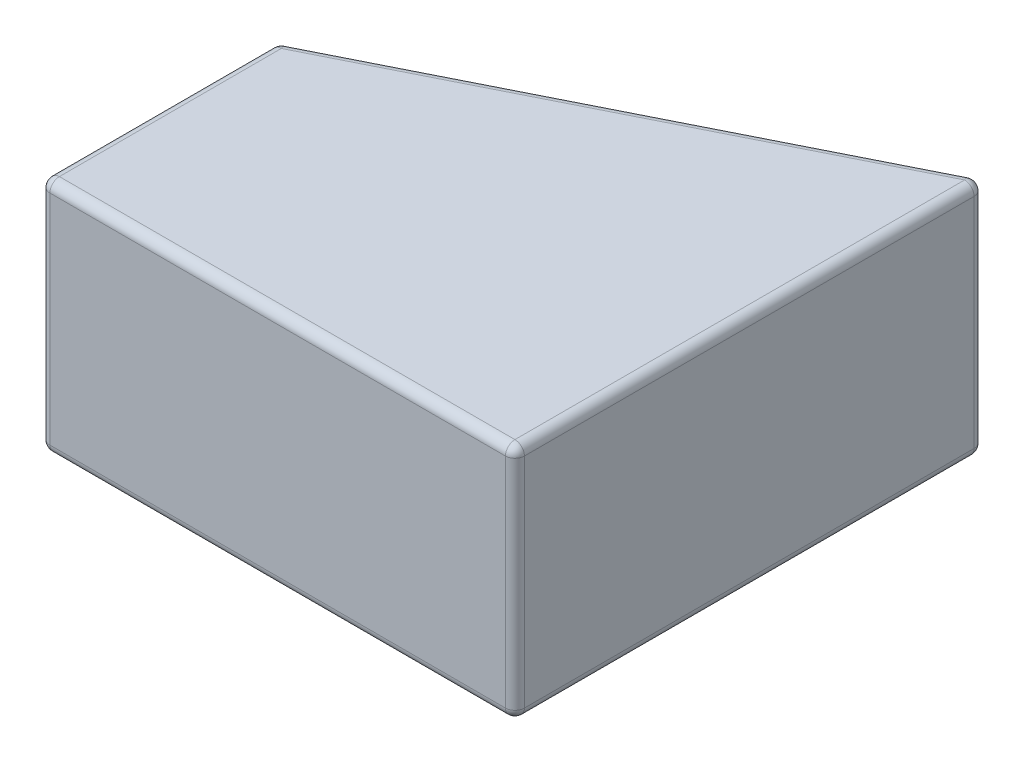
ISO-10303-21;
HEADER;
FILE_DESCRIPTION(('STEP AP214'),'2;1');
FILE_NAME('part.step','',(''),(''),'','','');
FILE_SCHEMA(('AUTOMOTIVE_DESIGN { 1 0 10303 214 1 1 1 1 }'));
ENDSEC;
DATA;
#1=APPLICATION_CONTEXT('core data for automotive mechanical design processes');
#2=APPLICATION_PROTOCOL_DEFINITION('international standard','automotive_design',2000,#1);
#3=PRODUCT_CONTEXT('',#1,'mechanical');
#4=PRODUCT('Part','Part','',(#3));
#5=PRODUCT_RELATED_PRODUCT_CATEGORY('part','',(#4));
#6=PRODUCT_DEFINITION_FORMATION('','',#4);
#7=PRODUCT_DEFINITION_CONTEXT('part definition',#1,'design');
#8=PRODUCT_DEFINITION('design','',#6,#7);
#9=PRODUCT_DEFINITION_SHAPE('','',#8);
#10=(LENGTH_UNIT() NAMED_UNIT(*) SI_UNIT(.MILLI.,.METRE.));
#11=(NAMED_UNIT(*) PLANE_ANGLE_UNIT() SI_UNIT($,.RADIAN.));
#12=(NAMED_UNIT(*) SI_UNIT($,.STERADIAN.) SOLID_ANGLE_UNIT());
#13=UNCERTAINTY_MEASURE_WITH_UNIT(LENGTH_MEASURE(1.E-05),#10,'distance_accuracy_value','');
#14=(GEOMETRIC_REPRESENTATION_CONTEXT(3) GLOBAL_UNCERTAINTY_ASSIGNED_CONTEXT((#13)) GLOBAL_UNIT_ASSIGNED_CONTEXT((#10,
#11,#12)) REPRESENTATION_CONTEXT('',''));
#15=CARTESIAN_POINT('',(0.,0.,0.));
#16=DIRECTION('',(0.,0.,1.));
#17=DIRECTION('',(1.,0.,0.));
#18=AXIS2_PLACEMENT_3D('',#15,#16,#17);
#19=CARTESIAN_POINT('',(10.,5.,0.));
#20=DIRECTION('',(1.,0.,0.));
#21=DIRECTION('',(0.,0.,-1.));
#22=AXIS2_PLACEMENT_3D('',#19,#20,#21);
#23=PLANE('',#22);
#24=DIRECTION('',(0.,-1.,0.));
#25=VECTOR('',#24,1.);
#26=CARTESIAN_POINT('',(10.,0.,-0.2));
#27=LINE('',#26,#25);
#28=CARTESIAN_POINT('',(10.,4.8,-0.2));
#29=VERTEX_POINT('',#28);
#30=CARTESIAN_POINT('',(10.,0.2,-0.2));
#31=VERTEX_POINT('',#30);
#32=EDGE_CURVE('E270',#29,#31,#27,.T.);
#33=ORIENTED_EDGE('',*,*,#32,.T.);
#34=DIRECTION('',(0.,0.,1.));
#35=VECTOR('',#34,1.);
#36=CARTESIAN_POINT('',(10.,0.2,-10.));
#37=LINE('',#36,#35);
#38=CARTESIAN_POINT('',(10.,0.2,-9.67639320225002));
#39=VERTEX_POINT('',#38);
#40=EDGE_CURVE('E170',#31,#39,#37,.F.);
#41=ORIENTED_EDGE('',*,*,#40,.T.);
#42=DIRECTION('',(0.,-1.,0.));
#43=VECTOR('',#42,1.);
#44=CARTESIAN_POINT('',(10.,5.,-9.67639320225002));
#45=LINE('',#44,#43);
#46=CARTESIAN_POINT('',(10.,4.8,-9.67639320225002));
#47=VERTEX_POINT('',#46);
#48=EDGE_CURVE('E264',#39,#47,#45,.F.);
#49=ORIENTED_EDGE('',*,*,#48,.T.);
#50=DIRECTION('',(0.,0.,1.));
#51=VECTOR('',#50,1.);
#52=CARTESIAN_POINT('',(10.,4.8,0.));
#53=LINE('',#52,#51);
#54=EDGE_CURVE('E267',#47,#29,#53,.T.);
#55=ORIENTED_EDGE('',*,*,#54,.T.);
#56=EDGE_LOOP('',(#33,#41,#49,#55));
#57=FACE_BOUND('',#56,.T.);
#58=ADVANCED_FACE('F43',(#57),#23,.T.);
#59=CARTESIAN_POINT('',(-2.,5.,-4.));
#60=DIRECTION('',(-0.447213595499958,0.,-0.894427190999916));
#61=DIRECTION('',(-0.894427190999916,0.,0.447213595499958));
#62=AXIS2_PLACEMENT_3D('',#59,#60,#61);
#63=PLANE('',#62);
#64=DIRECTION('',(0.894427190999916,0.,-0.447213595499958));
#65=VECTOR('',#64,1.);
#66=CARTESIAN_POINT('',(0.,0.2,-5.));
#67=LINE('',#66,#65);
#68=CARTESIAN_POINT('',(9.71055728090001,0.2,-9.85527864045));
#69=VERTEX_POINT('',#68);
#70=CARTESIAN_POINT('',(0.110557280900008,0.2,-5.05527864045));
#71=VERTEX_POINT('',#70);
#72=EDGE_CURVE('E326',#69,#71,#67,.F.);
#73=ORIENTED_EDGE('',*,*,#72,.T.);
#74=DIRECTION('',(0.,-1.,0.));
#75=VECTOR('',#74,1.);
#76=CARTESIAN_POINT('',(0.110557280900008,5.,-5.05527864045));
#77=LINE('',#76,#75);
#78=CARTESIAN_POINT('',(0.110557280900008,4.8,-5.05527864045));
#79=VERTEX_POINT('',#78);
#80=EDGE_CURVE('E257',#71,#79,#77,.F.);
#81=ORIENTED_EDGE('',*,*,#80,.T.);
#82=DIRECTION('',(0.894427190999916,0.,-0.447213595499958));
#83=VECTOR('',#82,1.);
#84=CARTESIAN_POINT('',(-2.,4.8,-4.));
#85=LINE('',#84,#83);
#86=CARTESIAN_POINT('',(9.71055728090001,4.8,-9.85527864045));
#87=VERTEX_POINT('',#86);
#88=EDGE_CURVE('E335',#79,#87,#85,.T.);
#89=ORIENTED_EDGE('',*,*,#88,.T.);
#90=DIRECTION('',(0.,-1.,0.));
#91=VECTOR('',#90,1.);
#92=CARTESIAN_POINT('',(9.71055728090001,5.,-9.85527864045));
#93=LINE('',#92,#91);
#94=EDGE_CURVE('E330',#87,#69,#93,.T.);
#95=ORIENTED_EDGE('',*,*,#94,.T.);
#96=EDGE_LOOP('',(#73,#81,#89,#95));
#97=FACE_BOUND('',#96,.T.);
#98=ADVANCED_FACE('F328',(#97),#63,.T.);
#99=CARTESIAN_POINT('',(0.,5.,0.));
#100=DIRECTION('',(-1.,0.,0.));
#101=DIRECTION('',(0.,0.,1.));
#102=AXIS2_PLACEMENT_3D('',#99,#100,#101);
#103=PLANE('',#102);
#104=DIRECTION('',(0.,-1.,0.));
#105=VECTOR('',#104,1.);
#106=CARTESIAN_POINT('',(0.,5.,-4.87639320225002));
#107=LINE('',#106,#105);
#108=CARTESIAN_POINT('',(0.,4.8,-4.87639320225002));
#109=VERTEX_POINT('',#108);
#110=CARTESIAN_POINT('',(0.,0.2,-4.87639320225002));
#111=VERTEX_POINT('',#110);
#112=EDGE_CURVE('E251',#109,#111,#107,.T.);
#113=ORIENTED_EDGE('',*,*,#112,.T.);
#114=DIRECTION('',(0.,0.,-1.));
#115=VECTOR('',#114,1.);
#116=CARTESIAN_POINT('',(0.,0.2,0.));
#117=LINE('',#116,#115);
#118=CARTESIAN_POINT('',(0.,0.2,-0.2));
#119=VERTEX_POINT('',#118);
#120=EDGE_CURVE('E255',#111,#119,#117,.F.);
#121=ORIENTED_EDGE('',*,*,#120,.T.);
#122=DIRECTION('',(0.,-1.,0.));
#123=VECTOR('',#122,1.);
#124=CARTESIAN_POINT('',(0.,5.,-0.2));
#125=LINE('',#124,#123);
#126=CARTESIAN_POINT('',(0.,4.8,-0.2));
#127=VERTEX_POINT('',#126);
#128=EDGE_CURVE('E250',#119,#127,#125,.F.);
#129=ORIENTED_EDGE('',*,*,#128,.T.);
#130=DIRECTION('',(0.,0.,-1.));
#131=VECTOR('',#130,1.);
#132=CARTESIAN_POINT('',(0.,4.8,0.));
#133=LINE('',#132,#131);
#134=EDGE_CURVE('E246',#127,#109,#133,.T.);
#135=ORIENTED_EDGE('',*,*,#134,.T.);
#136=EDGE_LOOP('',(#113,#121,#129,#135));
#137=FACE_BOUND('',#136,.T.);
#138=ADVANCED_FACE('F349',(#137),#103,.T.);
#139=CARTESIAN_POINT('',(0.,5.,0.));
#140=DIRECTION('',(0.,0.,-1.));
#141=DIRECTION('',(-1.,0.,0.));
#142=AXIS2_PLACEMENT_3D('',#139,#140,#141);
#143=PLANE('',#142);
#144=DIRECTION('',(1.,0.,0.));
#145=VECTOR('',#144,1.);
#146=CARTESIAN_POINT('',(0.,4.8,0.));
#147=LINE('',#146,#145);
#148=CARTESIAN_POINT('',(9.8,4.8,0.));
#149=VERTEX_POINT('',#148);
#150=CARTESIAN_POINT('',(0.2,4.8,0.));
#151=VERTEX_POINT('',#150);
#152=EDGE_CURVE('E281',#149,#151,#147,.F.);
#153=ORIENTED_EDGE('',*,*,#152,.T.);
#154=DIRECTION('',(0.,-1.,0.));
#155=VECTOR('',#154,1.);
#156=CARTESIAN_POINT('',(0.2,0.,0.));
#157=LINE('',#156,#155);
#158=CARTESIAN_POINT('',(0.2,0.2,0.));
#159=VERTEX_POINT('',#158);
#160=EDGE_CURVE('E284',#151,#159,#157,.T.);
#161=ORIENTED_EDGE('',*,*,#160,.T.);
#162=DIRECTION('',(1.,0.,0.));
#163=VECTOR('',#162,1.);
#164=CARTESIAN_POINT('',(0.,0.2,0.));
#165=LINE('',#164,#163);
#166=CARTESIAN_POINT('',(9.8,0.2,0.));
#167=VERTEX_POINT('',#166);
#168=EDGE_CURVE('E275',#159,#167,#165,.T.);
#169=ORIENTED_EDGE('',*,*,#168,.T.);
#170=DIRECTION('',(0.,-1.,0.));
#171=VECTOR('',#170,1.);
#172=CARTESIAN_POINT('',(9.8,5.,0.));
#173=LINE('',#172,#171);
#174=EDGE_CURVE('E278',#167,#149,#173,.F.);
#175=ORIENTED_EDGE('',*,*,#174,.T.);
#176=EDGE_LOOP('',(#153,#161,#169,#175));
#177=FACE_BOUND('',#176,.T.);
#178=ADVANCED_FACE('F355',(#177),#143,.F.);
#179=CARTESIAN_POINT('',(0.,5.,0.));
#180=DIRECTION('',(0.,1.,0.));
#181=DIRECTION('',(0.,0.,1.));
#182=AXIS2_PLACEMENT_3D('',#179,#180,#181);
#183=PLANE('',#182);
#184=DIRECTION('',(0.,0.,-1.));
#185=VECTOR('',#184,1.);
#186=CARTESIAN_POINT('',(0.2,5.,0.));
#187=LINE('',#186,#185);
#188=CARTESIAN_POINT('',(0.2,5.,-4.87639320225002));
#189=VERTEX_POINT('',#188);
#190=CARTESIAN_POINT('',(0.2,5.,-0.2));
#191=VERTEX_POINT('',#190);
#192=EDGE_CURVE('E53',#189,#191,#187,.F.);
#193=ORIENTED_EDGE('',*,*,#192,.T.);
#194=DIRECTION('',(1.,0.,0.));
#195=VECTOR('',#194,1.);
#196=CARTESIAN_POINT('',(10.,5.,-0.2));
#197=LINE('',#196,#195);
#198=CARTESIAN_POINT('',(9.8,5.,-0.2));
#199=VERTEX_POINT('',#198);
#200=EDGE_CURVE('E11',#191,#199,#197,.T.);
#201=ORIENTED_EDGE('',*,*,#200,.T.);
#202=DIRECTION('',(0.,0.,1.));
#203=VECTOR('',#202,1.);
#204=CARTESIAN_POINT('',(9.8,5.,0.));
#205=LINE('',#204,#203);
#206=CARTESIAN_POINT('',(9.8,5.,-9.67639320225002));
#207=VERTEX_POINT('',#206);
#208=EDGE_CURVE('E67',#199,#207,#205,.F.);
#209=ORIENTED_EDGE('',*,*,#208,.T.);
#210=DIRECTION('',(0.894427190999916,0.,-0.447213595499958));
#211=VECTOR('',#210,1.);
#212=CARTESIAN_POINT('',(-1.91055728090001,5.,-3.82111456180002));
#213=LINE('',#212,#211);
#214=EDGE_CURVE('E288',#207,#189,#213,.F.);
#215=ORIENTED_EDGE('',*,*,#214,.T.);
#216=EDGE_LOOP('',(#193,#201,#209,#215));
#217=FACE_BOUND('',#216,.T.);
#218=ADVANCED_FACE('F357',(#217),#183,.T.);
#219=CARTESIAN_POINT('',(0.,0.,0.));
#220=DIRECTION('',(0.,1.,0.));
#221=DIRECTION('',(0.,0.,1.));
#222=AXIS2_PLACEMENT_3D('',#219,#220,#221);
#223=PLANE('',#222);
#224=DIRECTION('',(0.,0.,-1.));
#225=VECTOR('',#224,1.);
#226=CARTESIAN_POINT('',(0.2,0.,-5.));
#227=LINE('',#226,#225);
#228=CARTESIAN_POINT('',(0.2,0.,-0.2));
#229=VERTEX_POINT('',#228);
#230=CARTESIAN_POINT('',(0.2,0.,-4.87639320225002));
#231=VERTEX_POINT('',#230);
#232=EDGE_CURVE('E146',#229,#231,#227,.T.);
#233=ORIENTED_EDGE('',*,*,#232,.T.);
#234=DIRECTION('',(0.894427190999916,0.,-0.447213595499958));
#235=VECTOR('',#234,1.);
#236=CARTESIAN_POINT('',(10.0894427191,0.,-9.82111456180002));
#237=LINE('',#236,#235);
#238=CARTESIAN_POINT('',(9.8,0.,-9.67639320225002));
#239=VERTEX_POINT('',#238);
#240=EDGE_CURVE('E141',#231,#239,#237,.T.);
#241=ORIENTED_EDGE('',*,*,#240,.T.);
#242=DIRECTION('',(0.,0.,1.));
#243=VECTOR('',#242,1.);
#244=CARTESIAN_POINT('',(9.8,0.,0.));
#245=LINE('',#244,#243);
#246=CARTESIAN_POINT('',(9.8,0.,-0.2));
#247=VERTEX_POINT('',#246);
#248=EDGE_CURVE('E135',#239,#247,#245,.T.);
#249=ORIENTED_EDGE('',*,*,#248,.T.);
#250=DIRECTION('',(1.,0.,0.));
#251=VECTOR('',#250,1.);
#252=CARTESIAN_POINT('',(0.,0.,-0.2));
#253=LINE('',#252,#251);
#254=EDGE_CURVE('E138',#247,#229,#253,.F.);
#255=ORIENTED_EDGE('',*,*,#254,.T.);
#256=EDGE_LOOP('',(#233,#241,#249,#255));
#257=FACE_BOUND('',#256,.T.);
#258=ADVANCED_FACE('F137',(#257),#223,.F.);
#259=CARTESIAN_POINT('',(0.,4.8,-0.2));
#260=DIRECTION('',(-1.,0.,0.));
#261=DIRECTION('',(0.,0.,1.));
#262=AXIS2_PLACEMENT_3D('',#259,#260,#261);
#263=CYLINDRICAL_SURFACE('',#262,0.2);
#264=CARTESIAN_POINT('',(0.2,4.8,-0.2));
#265=DIRECTION('',(-1.,0.,0.));
#266=DIRECTION('',(0.,0.,1.));
#267=AXIS2_PLACEMENT_3D('',#264,#265,#266);
#268=CIRCLE('',#267,0.2);
#269=EDGE_CURVE('E47',#151,#191,#268,.T.);
#270=ORIENTED_EDGE('',*,*,#269,.F.);
#271=ORIENTED_EDGE('',*,*,#152,.F.);
#272=CARTESIAN_POINT('',(9.8,4.8,-0.2));
#273=DIRECTION('',(1.,0.,0.));
#274=DIRECTION('',(0.,0.,-1.));
#275=AXIS2_PLACEMENT_3D('',#272,#273,#274);
#276=CIRCLE('',#275,0.2);
#277=EDGE_CURVE('E225',#199,#149,#276,.T.);
#278=ORIENTED_EDGE('',*,*,#277,.F.);
#279=ORIENTED_EDGE('',*,*,#200,.F.);
#280=EDGE_LOOP('',(#270,#271,#278,#279));
#281=FACE_BOUND('',#280,.T.);
#282=ADVANCED_FACE('F45',(#281),#263,.T.);
#283=CARTESIAN_POINT('',(0.2,4.8,-0.2));
#284=DIRECTION('',(0.,0.,1.));
#285=DIRECTION('',(1.,0.,0.));
#286=AXIS2_PLACEMENT_3D('',#283,#284,#285);
#287=SPHERICAL_SURFACE('',#286,0.2);
#288=CARTESIAN_POINT('',(0.2,4.8,-0.2));
#289=DIRECTION('',(0.,1.,0.));
#290=DIRECTION('',(0.,0.,1.));
#291=AXIS2_PLACEMENT_3D('',#288,#289,#290);
#292=CIRCLE('',#291,0.2);
#293=EDGE_CURVE('E218',#151,#127,#292,.F.);
#294=ORIENTED_EDGE('',*,*,#293,.F.);
#295=ORIENTED_EDGE('',*,*,#269,.T.);
#296=CARTESIAN_POINT('',(0.2,4.8,-0.2));
#297=DIRECTION('',(0.,0.,1.));
#298=DIRECTION('',(1.,0.,0.));
#299=AXIS2_PLACEMENT_3D('',#296,#297,#298);
#300=CIRCLE('',#299,0.2);
#301=EDGE_CURVE('E222',#127,#191,#300,.F.);
#302=ORIENTED_EDGE('',*,*,#301,.F.);
#303=EDGE_LOOP('',(#294,#295,#302));
#304=FACE_BOUND('',#303,.T.);
#305=ADVANCED_FACE('F237',(#304),#287,.T.);
#306=CARTESIAN_POINT('',(9.8,4.8,-0.2));
#307=DIRECTION('',(0.,0.,1.));
#308=DIRECTION('',(1.,0.,0.));
#309=AXIS2_PLACEMENT_3D('',#306,#307,#308);
#310=SPHERICAL_SURFACE('',#309,0.2);
#311=CARTESIAN_POINT('',(9.8,4.8,-0.2));
#312=DIRECTION('',(0.,0.,1.));
#313=DIRECTION('',(1.,0.,0.));
#314=AXIS2_PLACEMENT_3D('',#311,#312,#313);
#315=CIRCLE('',#314,0.2);
#316=EDGE_CURVE('E211',#199,#29,#315,.F.);
#317=ORIENTED_EDGE('',*,*,#316,.F.);
#318=ORIENTED_EDGE('',*,*,#277,.T.);
#319=CARTESIAN_POINT('',(9.8,4.8,-0.2));
#320=DIRECTION('',(0.,1.,0.));
#321=DIRECTION('',(0.,0.,1.));
#322=AXIS2_PLACEMENT_3D('',#319,#320,#321);
#323=CIRCLE('',#322,0.2);
#324=EDGE_CURVE('E214',#29,#149,#323,.F.);
#325=ORIENTED_EDGE('',*,*,#324,.F.);
#326=EDGE_LOOP('',(#317,#318,#325));
#327=FACE_BOUND('',#326,.T.);
#328=ADVANCED_FACE('F413',(#327),#310,.T.);
#329=CARTESIAN_POINT('',(0.2,4.8,0.));
#330=DIRECTION('',(0.,0.,-1.));
#331=DIRECTION('',(-1.,0.,0.));
#332=AXIS2_PLACEMENT_3D('',#329,#330,#331);
#333=CYLINDRICAL_SURFACE('',#332,0.2);
#334=ORIENTED_EDGE('',*,*,#301,.T.);
#335=ORIENTED_EDGE('',*,*,#192,.F.);
#336=CARTESIAN_POINT('',(0.2,4.8,-4.87639320225002));
#337=DIRECTION('',(0.,0.,-1.));
#338=DIRECTION('',(-1.,0.,0.));
#339=AXIS2_PLACEMENT_3D('',#336,#337,#338);
#340=CIRCLE('',#339,0.2);
#341=EDGE_CURVE('E203',#109,#189,#340,.T.);
#342=ORIENTED_EDGE('',*,*,#341,.F.);
#343=ORIENTED_EDGE('',*,*,#134,.F.);
#344=EDGE_LOOP('',(#334,#335,#342,#343));
#345=FACE_BOUND('',#344,.T.);
#346=ADVANCED_FACE('F243',(#345),#333,.T.);
#347=CARTESIAN_POINT('',(0.2,5.,-0.2));
#348=DIRECTION('',(0.,1.,0.));
#349=DIRECTION('',(0.,0.,1.));
#350=AXIS2_PLACEMENT_3D('',#347,#348,#349);
#351=CYLINDRICAL_SURFACE('',#350,0.2);
#352=ORIENTED_EDGE('',*,*,#293,.T.);
#353=ORIENTED_EDGE('',*,*,#128,.F.);
#354=CARTESIAN_POINT('',(0.2,0.2,-0.2));
#355=DIRECTION('',(0.,-1.,0.));
#356=DIRECTION('',(1.,0.,0.));
#357=AXIS2_PLACEMENT_3D('',#354,#355,#356);
#358=CIRCLE('',#357,0.2);
#359=EDGE_CURVE('E199',#159,#119,#358,.T.);
#360=ORIENTED_EDGE('',*,*,#359,.F.);
#361=ORIENTED_EDGE('',*,*,#160,.F.);
#362=EDGE_LOOP('',(#352,#353,#360,#361));
#363=FACE_BOUND('',#362,.T.);
#364=ADVANCED_FACE('F353',(#363),#351,.T.);
#365=CARTESIAN_POINT('',(0.,0.2,-0.2));
#366=DIRECTION('',(1.,0.,0.));
#367=DIRECTION('',(0.,0.,-1.));
#368=AXIS2_PLACEMENT_3D('',#365,#366,#367);
#369=CYLINDRICAL_SURFACE('',#368,0.2);
#370=CARTESIAN_POINT('',(9.8,0.2,-0.2));
#371=DIRECTION('',(1.,0.,0.));
#372=DIRECTION('',(0.,0.,-1.));
#373=AXIS2_PLACEMENT_3D('',#370,#371,#372);
#374=CIRCLE('',#373,0.2);
#375=EDGE_CURVE('E153',#167,#247,#374,.T.);
#376=ORIENTED_EDGE('',*,*,#375,.F.);
#377=ORIENTED_EDGE('',*,*,#168,.F.);
#378=CARTESIAN_POINT('',(0.2,0.2,-0.2));
#379=DIRECTION('',(-1.,0.,0.));
#380=DIRECTION('',(0.,0.,1.));
#381=AXIS2_PLACEMENT_3D('',#378,#379,#380);
#382=CIRCLE('',#381,0.2);
#383=EDGE_CURVE('E155',#229,#159,#382,.T.);
#384=ORIENTED_EDGE('',*,*,#383,.F.);
#385=ORIENTED_EDGE('',*,*,#254,.F.);
#386=EDGE_LOOP('',(#376,#377,#384,#385));
#387=FACE_BOUND('',#386,.T.);
#388=ADVANCED_FACE('F151',(#387),#369,.T.);
#389=CARTESIAN_POINT('',(9.8,5.,-0.2));
#390=DIRECTION('',(0.,1.,0.));
#391=DIRECTION('',(0.,0.,1.));
#392=AXIS2_PLACEMENT_3D('',#389,#390,#391);
#393=CYLINDRICAL_SURFACE('',#392,0.2);
#394=ORIENTED_EDGE('',*,*,#324,.T.);
#395=ORIENTED_EDGE('',*,*,#174,.F.);
#396=CARTESIAN_POINT('',(9.8,0.2,-0.2));
#397=DIRECTION('',(0.,-1.,0.));
#398=DIRECTION('',(0.,0.,-1.));
#399=AXIS2_PLACEMENT_3D('',#396,#397,#398);
#400=CIRCLE('',#399,0.2);
#401=EDGE_CURVE('E165',#31,#167,#400,.T.);
#402=ORIENTED_EDGE('',*,*,#401,.F.);
#403=ORIENTED_EDGE('',*,*,#32,.F.);
#404=EDGE_LOOP('',(#394,#395,#402,#403));
#405=FACE_BOUND('',#404,.T.);
#406=ADVANCED_FACE('F437',(#405),#393,.T.);
#407=CARTESIAN_POINT('',(9.8,4.8,0.));
#408=DIRECTION('',(0.,0.,1.));
#409=DIRECTION('',(1.,0.,0.));
#410=AXIS2_PLACEMENT_3D('',#407,#408,#409);
#411=CYLINDRICAL_SURFACE('',#410,0.2);
#412=ORIENTED_EDGE('',*,*,#316,.T.);
#413=ORIENTED_EDGE('',*,*,#54,.F.);
#414=CARTESIAN_POINT('',(9.8,4.8,-9.67639320225002));
#415=DIRECTION('',(0.,0.,-1.));
#416=DIRECTION('',(-1.,0.,0.));
#417=AXIS2_PLACEMENT_3D('',#414,#415,#416);
#418=CIRCLE('',#417,0.2);
#419=EDGE_CURVE('E191',#207,#47,#418,.T.);
#420=ORIENTED_EDGE('',*,*,#419,.F.);
#421=ORIENTED_EDGE('',*,*,#208,.F.);
#422=EDGE_LOOP('',(#412,#413,#420,#421));
#423=FACE_BOUND('',#422,.T.);
#424=ADVANCED_FACE('F364',(#423),#411,.T.);
#425=CARTESIAN_POINT('',(-1.91055728090001,4.8,-3.82111456180002));
#426=DIRECTION('',(0.894427190999916,0.,-0.447213595499958));
#427=DIRECTION('',(-0.447213595499958,0.,-0.894427190999916));
#428=AXIS2_PLACEMENT_3D('',#425,#426,#427);
#429=CYLINDRICAL_SURFACE('',#428,0.2);
#430=CARTESIAN_POINT('',(0.2,4.8,-4.87639320225002));
#431=DIRECTION('',(-0.894427190999916,0.,0.447213595499958));
#432=DIRECTION('',(0.447213595499958,0.,0.894427190999916));
#433=AXIS2_PLACEMENT_3D('',#430,#431,#432);
#434=CIRCLE('',#433,0.2);
#435=EDGE_CURVE('E207',#189,#79,#434,.T.);
#436=ORIENTED_EDGE('',*,*,#435,.F.);
#437=ORIENTED_EDGE('',*,*,#214,.F.);
#438=CARTESIAN_POINT('',(9.8,4.8,-9.67639320225002));
#439=DIRECTION('',(0.894427190999916,0.,-0.447213595499958));
#440=DIRECTION('',(-0.447213595499958,0.,-0.894427190999916));
#441=AXIS2_PLACEMENT_3D('',#438,#439,#440);
#442=CIRCLE('',#441,0.2);
#443=EDGE_CURVE('E187',#87,#207,#442,.T.);
#444=ORIENTED_EDGE('',*,*,#443,.F.);
#445=ORIENTED_EDGE('',*,*,#88,.F.);
#446=EDGE_LOOP('',(#436,#437,#444,#445));
#447=FACE_BOUND('',#446,.T.);
#448=ADVANCED_FACE('F361',(#447),#429,.T.);
#449=CARTESIAN_POINT('',(0.2,4.8,-4.87639320225002));
#450=DIRECTION('',(0.,0.,1.));
#451=DIRECTION('',(1.,0.,0.));
#452=AXIS2_PLACEMENT_3D('',#449,#450,#451);
#453=SPHERICAL_SURFACE('',#452,0.2);
#454=ORIENTED_EDGE('',*,*,#341,.T.);
#455=ORIENTED_EDGE('',*,*,#435,.T.);
#456=CARTESIAN_POINT('',(0.2,4.8,-4.87639320225002));
#457=DIRECTION('',(0.,1.,0.));
#458=DIRECTION('',(0.,0.,1.));
#459=AXIS2_PLACEMENT_3D('',#456,#457,#458);
#460=CIRCLE('',#459,0.2);
#461=EDGE_CURVE('E177',#109,#79,#460,.F.);
#462=ORIENTED_EDGE('',*,*,#461,.F.);
#463=EDGE_LOOP('',(#454,#455,#462));
#464=FACE_BOUND('',#463,.T.);
#465=ADVANCED_FACE('F457',(#464),#453,.T.);
#466=CARTESIAN_POINT('',(0.2,0.2,-0.2));
#467=DIRECTION('',(0.,0.,1.));
#468=DIRECTION('',(1.,0.,0.));
#469=AXIS2_PLACEMENT_3D('',#466,#467,#468);
#470=SPHERICAL_SURFACE('',#469,0.2);
#471=ORIENTED_EDGE('',*,*,#383,.T.);
#472=ORIENTED_EDGE('',*,*,#359,.T.);
#473=CARTESIAN_POINT('',(0.2,0.2,-0.2));
#474=DIRECTION('',(0.,0.,1.));
#475=DIRECTION('',(1.,0.,0.));
#476=AXIS2_PLACEMENT_3D('',#473,#474,#475);
#477=CIRCLE('',#476,0.2);
#478=EDGE_CURVE('E172',#229,#119,#477,.F.);
#479=ORIENTED_EDGE('',*,*,#478,.F.);
#480=EDGE_LOOP('',(#471,#472,#479));
#481=FACE_BOUND('',#480,.T.);
#482=ADVANCED_FACE('F464',(#481),#470,.T.);
#483=CARTESIAN_POINT('',(9.8,0.2,-0.2));
#484=DIRECTION('',(0.,0.,1.));
#485=DIRECTION('',(1.,0.,0.));
#486=AXIS2_PLACEMENT_3D('',#483,#484,#485);
#487=SPHERICAL_SURFACE('',#486,0.2);
#488=ORIENTED_EDGE('',*,*,#401,.T.);
#489=ORIENTED_EDGE('',*,*,#375,.T.);
#490=CARTESIAN_POINT('',(9.8,0.2,-0.2));
#491=DIRECTION('',(0.,0.,1.));
#492=DIRECTION('',(1.,0.,0.));
#493=AXIS2_PLACEMENT_3D('',#490,#491,#492);
#494=CIRCLE('',#493,0.2);
#495=EDGE_CURVE('E162',#31,#247,#494,.F.);
#496=ORIENTED_EDGE('',*,*,#495,.F.);
#497=EDGE_LOOP('',(#488,#489,#496));
#498=FACE_BOUND('',#497,.T.);
#499=ADVANCED_FACE('F161',(#498),#487,.T.);
#500=CARTESIAN_POINT('',(9.8,4.8,-9.67639320225002));
#501=DIRECTION('',(0.,0.,1.));
#502=DIRECTION('',(1.,0.,0.));
#503=AXIS2_PLACEMENT_3D('',#500,#501,#502);
#504=SPHERICAL_SURFACE('',#503,0.2);
#505=ORIENTED_EDGE('',*,*,#443,.T.);
#506=ORIENTED_EDGE('',*,*,#419,.T.);
#507=CARTESIAN_POINT('',(9.8,4.8,-9.67639320225002));
#508=DIRECTION('',(0.,1.,0.));
#509=DIRECTION('',(0.,0.,1.));
#510=AXIS2_PLACEMENT_3D('',#507,#508,#509);
#511=CIRCLE('',#510,0.2);
#512=EDGE_CURVE('E173',#87,#47,#511,.F.);
#513=ORIENTED_EDGE('',*,*,#512,.F.);
#514=EDGE_LOOP('',(#505,#506,#513));
#515=FACE_BOUND('',#514,.T.);
#516=ADVANCED_FACE('F366',(#515),#504,.T.);
#517=CARTESIAN_POINT('',(0.2,5.,-4.87639320225002));
#518=DIRECTION('',(0.,-1.,0.));
#519=DIRECTION('',(0.,0.,-1.));
#520=AXIS2_PLACEMENT_3D('',#517,#518,#519);
#521=CYLINDRICAL_SURFACE('',#520,0.2);
#522=ORIENTED_EDGE('',*,*,#461,.T.);
#523=ORIENTED_EDGE('',*,*,#80,.F.);
#524=CARTESIAN_POINT('',(0.2,0.2,-4.87639320225002));
#525=DIRECTION('',(0.,-1.,0.));
#526=DIRECTION('',(0.,0.,-1.));
#527=AXIS2_PLACEMENT_3D('',#524,#525,#526);
#528=CIRCLE('',#527,0.2);
#529=EDGE_CURVE('E180',#111,#71,#528,.T.);
#530=ORIENTED_EDGE('',*,*,#529,.F.);
#531=ORIENTED_EDGE('',*,*,#112,.F.);
#532=EDGE_LOOP('',(#522,#523,#530,#531));
#533=FACE_BOUND('',#532,.T.);
#534=ADVANCED_FACE('F322',(#533),#521,.T.);
#535=CARTESIAN_POINT('',(0.2,0.2,0.));
#536=DIRECTION('',(0.,0.,1.));
#537=DIRECTION('',(1.,0.,0.));
#538=AXIS2_PLACEMENT_3D('',#535,#536,#537);
#539=CYLINDRICAL_SURFACE('',#538,0.2);
#540=ORIENTED_EDGE('',*,*,#478,.T.);
#541=ORIENTED_EDGE('',*,*,#120,.F.);
#542=CARTESIAN_POINT('',(0.2,0.2,-4.87639320225002));
#543=DIRECTION('',(0.,0.,-1.));
#544=DIRECTION('',(-1.,0.,0.));
#545=AXIS2_PLACEMENT_3D('',#542,#543,#544);
#546=CIRCLE('',#545,0.2);
#547=EDGE_CURVE('E308',#231,#111,#546,.T.);
#548=ORIENTED_EDGE('',*,*,#547,.F.);
#549=ORIENTED_EDGE('',*,*,#232,.F.);
#550=EDGE_LOOP('',(#540,#541,#548,#549));
#551=FACE_BOUND('',#550,.T.);
#552=ADVANCED_FACE('F348',(#551),#539,.T.);
#553=CARTESIAN_POINT('',(9.8,0.2,0.));
#554=DIRECTION('',(0.,0.,-1.));
#555=DIRECTION('',(-1.,0.,0.));
#556=AXIS2_PLACEMENT_3D('',#553,#554,#555);
#557=CYLINDRICAL_SURFACE('',#556,0.2);
#558=ORIENTED_EDGE('',*,*,#495,.T.);
#559=ORIENTED_EDGE('',*,*,#248,.F.);
#560=CARTESIAN_POINT('',(9.8,0.2,-9.67639320225002));
#561=DIRECTION('',(0.,0.,-1.));
#562=DIRECTION('',(0.,1.,0.));
#563=AXIS2_PLACEMENT_3D('',#560,#561,#562);
#564=CIRCLE('',#563,0.2);
#565=EDGE_CURVE('E304',#39,#239,#564,.T.);
#566=ORIENTED_EDGE('',*,*,#565,.F.);
#567=ORIENTED_EDGE('',*,*,#40,.F.);
#568=EDGE_LOOP('',(#558,#559,#566,#567));
#569=FACE_BOUND('',#568,.T.);
#570=ADVANCED_FACE('F168',(#569),#557,.T.);
#571=CARTESIAN_POINT('',(9.8,5.,-9.67639320225002));
#572=DIRECTION('',(0.,-1.,0.));
#573=DIRECTION('',(0.,0.,-1.));
#574=AXIS2_PLACEMENT_3D('',#571,#572,#573);
#575=CYLINDRICAL_SURFACE('',#574,0.2);
#576=ORIENTED_EDGE('',*,*,#512,.T.);
#577=ORIENTED_EDGE('',*,*,#48,.F.);
#578=CARTESIAN_POINT('',(9.8,0.2,-9.67639320225002));
#579=DIRECTION('',(0.,-1.,0.));
#580=DIRECTION('',(0.,0.,-1.));
#581=AXIS2_PLACEMENT_3D('',#578,#579,#580);
#582=CIRCLE('',#581,0.2);
#583=EDGE_CURVE('E301',#69,#39,#582,.T.);
#584=ORIENTED_EDGE('',*,*,#583,.F.);
#585=ORIENTED_EDGE('',*,*,#94,.F.);
#586=EDGE_LOOP('',(#576,#577,#584,#585));
#587=FACE_BOUND('',#586,.T.);
#588=ADVANCED_FACE('F369',(#587),#575,.T.);
#589=CARTESIAN_POINT('',(0.2,0.2,-4.87639320225002));
#590=DIRECTION('',(0.,0.,1.));
#591=DIRECTION('',(1.,0.,0.));
#592=AXIS2_PLACEMENT_3D('',#589,#590,#591);
#593=SPHERICAL_SURFACE('',#592,0.2);
#594=ORIENTED_EDGE('',*,*,#547,.T.);
#595=ORIENTED_EDGE('',*,*,#529,.T.);
#596=CARTESIAN_POINT('',(0.2,0.2,-4.87639320225002));
#597=DIRECTION('',(-0.894427190999916,0.,0.447213595499957));
#598=DIRECTION('',(0.447213595499958,0.,0.894427190999916));
#599=AXIS2_PLACEMENT_3D('',#596,#597,#598);
#600=CIRCLE('',#599,0.2);
#601=EDGE_CURVE('E298',#231,#71,#600,.F.);
#602=ORIENTED_EDGE('',*,*,#601,.F.);
#603=EDGE_LOOP('',(#594,#595,#602));
#604=FACE_BOUND('',#603,.T.);
#605=ADVANCED_FACE('F317',(#604),#593,.T.);
#606=CARTESIAN_POINT('',(9.8,0.2,-9.67639320225002));
#607=DIRECTION('',(0.,0.,1.));
#608=DIRECTION('',(1.,0.,0.));
#609=AXIS2_PLACEMENT_3D('',#606,#607,#608);
#610=SPHERICAL_SURFACE('',#609,0.2);
#611=ORIENTED_EDGE('',*,*,#583,.T.);
#612=ORIENTED_EDGE('',*,*,#565,.T.);
#613=CARTESIAN_POINT('',(9.8,0.2,-9.67639320225002));
#614=DIRECTION('',(0.894427190999914,0.,-0.447213595499961));
#615=DIRECTION('',(-0.447213595499961,0.,-0.894427190999914));
#616=AXIS2_PLACEMENT_3D('',#613,#614,#615);
#617=CIRCLE('',#616,0.2);
#618=EDGE_CURVE('E295',#69,#239,#617,.F.);
#619=ORIENTED_EDGE('',*,*,#618,.F.);
#620=EDGE_LOOP('',(#611,#612,#619));
#621=FACE_BOUND('',#620,.T.);
#622=ADVANCED_FACE('F371',(#621),#610,.T.);
#623=CARTESIAN_POINT('',(-1.91055728090001,0.2,-3.82111456180002));
#624=DIRECTION('',(-0.894427190999916,0.,0.447213595499958));
#625=DIRECTION('',(0.447213595499958,0.,0.894427190999916));
#626=AXIS2_PLACEMENT_3D('',#623,#624,#625);
#627=CYLINDRICAL_SURFACE('',#626,0.2);
#628=ORIENTED_EDGE('',*,*,#601,.T.);
#629=ORIENTED_EDGE('',*,*,#72,.F.);
#630=ORIENTED_EDGE('',*,*,#618,.T.);
#631=ORIENTED_EDGE('',*,*,#240,.F.);
#632=EDGE_LOOP('',(#628,#629,#630,#631));
#633=FACE_BOUND('',#632,.T.);
#634=ADVANCED_FACE('F372',(#633),#627,.T.);
#635=CLOSED_SHELL('',(#58,#98,#138,#178,#218,#258,#282,#305,#328,#346,#364,#388,#406,#424,#448,
#465,#482,#499,#516,#534,#552,#570,#588,#605,#622,#634));
#636=MANIFOLD_SOLID_BREP('B2',#635);
#637=ADVANCED_BREP_SHAPE_REPRESENTATION('',(#18,#636),#14);
#638=SHAPE_DEFINITION_REPRESENTATION(#9,#637);
ENDSEC;
END-ISO-10303-21;
